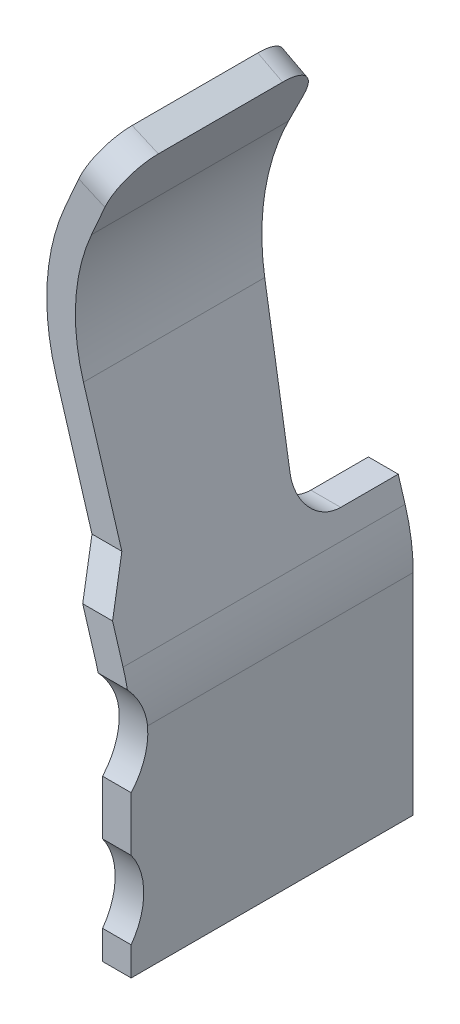
ISO-10303-21;
HEADER;
FILE_DESCRIPTION(('STEP AP214'),'2;1');
FILE_NAME('part.step','',(''),(''),'','','');
FILE_SCHEMA(('AUTOMOTIVE_DESIGN { 1 0 10303 214 1 1 1 1 }'));
ENDSEC;
DATA;
#1=APPLICATION_CONTEXT('core data for automotive mechanical design processes');
#2=APPLICATION_PROTOCOL_DEFINITION('international standard','automotive_design',2000,#1);
#3=PRODUCT_CONTEXT('',#1,'mechanical');
#4=PRODUCT('Part','Part','',(#3));
#5=PRODUCT_RELATED_PRODUCT_CATEGORY('part','',(#4));
#6=PRODUCT_DEFINITION_FORMATION('','',#4);
#7=PRODUCT_DEFINITION_CONTEXT('part definition',#1,'design');
#8=PRODUCT_DEFINITION('design','',#6,#7);
#9=PRODUCT_DEFINITION_SHAPE('','',#8);
#10=(LENGTH_UNIT() NAMED_UNIT(*) SI_UNIT(.MILLI.,.METRE.));
#11=(NAMED_UNIT(*) PLANE_ANGLE_UNIT() SI_UNIT($,.RADIAN.));
#12=(NAMED_UNIT(*) SI_UNIT($,.STERADIAN.) SOLID_ANGLE_UNIT());
#13=UNCERTAINTY_MEASURE_WITH_UNIT(LENGTH_MEASURE(1.E-05),#10,'distance_accuracy_value','');
#14=(GEOMETRIC_REPRESENTATION_CONTEXT(3) GLOBAL_UNCERTAINTY_ASSIGNED_CONTEXT((#13)) GLOBAL_UNIT_ASSIGNED_CONTEXT((#10,
#11,#12)) REPRESENTATION_CONTEXT('',''));
#15=CARTESIAN_POINT('',(0.,0.,0.));
#16=DIRECTION('',(0.,0.,1.));
#17=DIRECTION('',(1.,0.,0.));
#18=AXIS2_PLACEMENT_3D('',#15,#16,#17);
#19=CARTESIAN_POINT('',(6.95844493318108,3.52330708865174,0.423604352914839));
#20=DIRECTION('',(0.915327071470027,-0.402711251685502,0.));
#21=DIRECTION('',(0.402711251685502,0.915327071470027,0.));
#22=AXIS2_PLACEMENT_3D('',#19,#20,#21);
#23=CYLINDRICAL_SURFACE('',#22,0.2);
#24=CARTESIAN_POINT('',(6.95844493318108,3.52330708865174,0.423604352914839));
#25=DIRECTION('',(-0.915327071470027,0.402711251685502,0.));
#26=DIRECTION('',(0.402711251685502,0.915327071470027,0.));
#27=AXIS2_PLACEMENT_3D('',#24,#25,#26);
#28=CIRCLE('',#27,0.2);
#29=CARTESIAN_POINT('',(6.95844493318108,3.52330708865174,0.623604352914839));
#30=VERTEX_POINT('',#29);
#31=CARTESIAN_POINT('',(7.03898718351818,3.70637250294574,0.423604352914839));
#32=VERTEX_POINT('',#31);
#33=EDGE_CURVE('E378',#30,#32,#28,.T.);
#34=ORIENTED_EDGE('',*,*,#33,.F.);
#35=DIRECTION('',(-0.915327071470027,0.402711251685503,0.));
#36=VECTOR('',#35,1.);
#37=CARTESIAN_POINT('',(-17.6515059297135,14.3508073613119,0.623604352914805));
#38=LINE('',#37,#36);
#39=CARTESIAN_POINT('',(7.09574399390159,3.46290040089891,0.623604352914839));
#40=VERTEX_POINT('',#39);
#41=EDGE_CURVE('E26',#40,#30,#38,.T.);
#42=ORIENTED_EDGE('',*,*,#41,.F.);
#43=CARTESIAN_POINT('',(7.09574399390159,3.46290040089891,0.423604352914839));
#44=DIRECTION('',(0.915327071470027,-0.402711251685502,0.));
#45=DIRECTION('',(-0.402711251685502,-0.915327071470027,0.));
#46=AXIS2_PLACEMENT_3D('',#43,#44,#45);
#47=CIRCLE('',#46,0.2);
#48=CARTESIAN_POINT('',(7.17628624423868,3.64596581519291,0.423604352914839));
#49=VERTEX_POINT('',#48);
#50=EDGE_CURVE('E396',#49,#40,#47,.T.);
#51=ORIENTED_EDGE('',*,*,#50,.F.);
#52=DIRECTION('',(0.915327071470027,-0.402711251685503,0.));
#53=VECTOR('',#52,1.);
#54=CARTESIAN_POINT('',(7.03898718351818,3.70637250294574,0.423604352914839));
#55=LINE('',#54,#53);
#56=EDGE_CURVE('E336',#32,#49,#55,.T.);
#57=ORIENTED_EDGE('',*,*,#56,.F.);
#58=EDGE_LOOP('',(#34,#42,#51,#57));
#59=FACE_BOUND('',#58,.T.);
#60=ADVANCED_FACE('F16',(#59),#23,.T.);
#61=CARTESIAN_POINT('',(6.93613725867001,3.53312166947706,-0.236832722369337));
#62=DIRECTION('',(-0.914255270392899,0.402239697454472,-0.0483789866630451));
#63=DIRECTION('',(-0.402711251685501,-0.915327071470027,0.));
#64=AXIS2_PLACEMENT_3D('',#61,#62,#63);
#65=CYLINDRICAL_SURFACE('',#64,0.2);
#66=CARTESIAN_POINT('',(7.08694053804578,3.44289092405021,-0.427421697659668));
#67=CARTESIAN_POINT('',(7.13801746519236,3.55898426375477,-0.441384710680955));
#68=CARTESIAN_POINT('',(7.17628624423868,3.64596581519291,-0.356133634256613));
#69=CARTESIAN_POINT('',(7.17628624423869,3.64596581519291,-0.228386927890316));
#70=(BOUNDED_CURVE() B_SPLINE_CURVE(3,(#66,#67,#68,#69),.UNSPECIFIED.,.F.,
.F.) B_SPLINE_CURVE_WITH_KNOTS((4,4),(6.17366415670651,7.85398163397443),
.UNSPECIFIED.) CURVE() GEOMETRIC_REPRESENTATION_ITEM() RATIONAL_B_SPLINE_CURVE((1.,
0.77822974253387,0.77822974253387,1.)) REPRESENTATION_ITEM(''));
#71=CARTESIAN_POINT('',(7.08694053804578,3.44289092405021,-0.427421697659668));
#72=VERTEX_POINT('',#71);
#73=CARTESIAN_POINT('',(7.17628624423869,3.64596581519291,-0.228386927890316));
#74=VERTEX_POINT('',#73);
#75=EDGE_CURVE('E335',#72,#74,#70,.T.);
#76=ORIENTED_EDGE('',*,*,#75,.F.);
#77=DIRECTION('',(0.914255270392898,-0.402239697454473,0.0483789866630451));
#78=VECTOR('',#77,1.);
#79=CARTESIAN_POINT('',(-18.251852655037,14.5910558161891,-1.76825633941021));
#80=LINE('',#79,#78);
#81=CARTESIAN_POINT('',(6.94964147732528,3.50329761180303,-0.434687053017796));
#82=VERTEX_POINT('',#81);
#83=EDGE_CURVE('E11',#82,#72,#80,.T.);
#84=ORIENTED_EDGE('',*,*,#83,.F.);
#85=CARTESIAN_POINT('',(7.03898718351819,3.70637250294574,-0.235652283248443));
#86=CARTESIAN_POINT('',(7.03898718351819,3.70637250294574,-0.363398989614741));
#87=CARTESIAN_POINT('',(7.00071840447187,3.6193909515076,-0.448650066039083));
#88=CARTESIAN_POINT('',(6.94964147732528,3.50329761180303,-0.434687053017796));
#89=(BOUNDED_CURVE() B_SPLINE_CURVE(3,(#85,#86,#87,#88),.UNSPECIFIED.,.F.,
.F.) B_SPLINE_CURVE_WITH_KNOTS((4,4),(4.71238898038476,6.39270645765268),
.UNSPECIFIED.) CURVE() GEOMETRIC_REPRESENTATION_ITEM() RATIONAL_B_SPLINE_CURVE((1.,
0.77822974253387,0.77822974253387,1.)) REPRESENTATION_ITEM(''));
#90=CARTESIAN_POINT('',(7.03898718351819,3.70637250294574,-0.235652283248443));
#91=VERTEX_POINT('',#90);
#92=EDGE_CURVE('E373',#91,#82,#89,.T.);
#93=ORIENTED_EDGE('',*,*,#92,.F.);
#94=DIRECTION('',(-0.914255270392898,0.402239697454473,-0.0483789866630451));
#95=VECTOR('',#94,1.);
#96=CARTESIAN_POINT('',(7.01667950900711,3.71618708377106,-0.236832722369337));
#97=LINE('',#96,#95);
#98=EDGE_CURVE('E353',#74,#91,#97,.T.);
#99=ORIENTED_EDGE('',*,*,#98,.F.);
#100=EDGE_LOOP('',(#76,#84,#93,#99));
#101=FACE_BOUND('',#100,.T.);
#102=ADVANCED_FACE('F509',(#101),#65,.T.);
#103=CARTESIAN_POINT('',(-23.11,1.65634067151207,-0.212546111318104));
#104=DIRECTION('',(0.,-1.,0.));
#105=DIRECTION('',(0.,0.,-1.));
#106=AXIS2_PLACEMENT_3D('',#103,#104,#105);
#107=PLANE('',#106);
#108=DIRECTION('',(0.,0.,-1.));
#109=VECTOR('',#108,1.);
#110=CARTESIAN_POINT('',(7.11483507894154,1.65634067151207,-0.740000000000018));
#111=LINE('',#110,#109);
#112=CARTESIAN_POINT('',(7.11483507894154,1.65634067151207,-0.438042305987952));
#113=VERTEX_POINT('',#112);
#114=CARTESIAN_POINT('',(7.11483507894154,1.65634067151207,-0.740000000000018));
#115=VERTEX_POINT('',#114);
#116=EDGE_CURVE('E316',#113,#115,#111,.T.);
#117=ORIENTED_EDGE('',*,*,#116,.F.);
#118=DIRECTION('',(1.,0.,0.));
#119=VECTOR('',#118,1.);
#120=CARTESIAN_POINT('',(7.27150340910557,1.65634067151207,-0.438042305987951));
#121=LINE('',#120,#119);
#122=CARTESIAN_POINT('',(7.27150340910558,1.65634067151207,-0.438042305987951));
#123=VERTEX_POINT('',#122);
#124=EDGE_CURVE('E292',#113,#123,#121,.T.);
#125=ORIENTED_EDGE('',*,*,#124,.T.);
#126=DIRECTION('',(0.,0.,1.));
#127=VECTOR('',#126,1.);
#128=CARTESIAN_POINT('',(7.27150340910558,1.65634067151207,-0.740000000000018));
#129=LINE('',#128,#127);
#130=CARTESIAN_POINT('',(7.27150340910558,1.65634067151207,-0.740000000000018));
#131=VERTEX_POINT('',#130);
#132=EDGE_CURVE('E258',#131,#123,#129,.T.);
#133=ORIENTED_EDGE('',*,*,#132,.F.);
#134=DIRECTION('',(-1.,0.,0.));
#135=VECTOR('',#134,1.);
#136=CARTESIAN_POINT('',(6.35,1.65634067151207,-0.740000000000019));
#137=LINE('',#136,#135);
#138=EDGE_CURVE('E255',#131,#115,#137,.T.);
#139=ORIENTED_EDGE('',*,*,#138,.T.);
#140=EDGE_LOOP('',(#117,#125,#133,#139));
#141=FACE_BOUND('',#140,.T.);
#142=ADVANCED_FACE('F488',(#141),#107,.F.);
#143=CARTESIAN_POINT('',(-23.11,3.70637250294571,-0.459111687165995));
#144=DIRECTION('',(0.,0.119413416546905,0.992844618230162));
#145=DIRECTION('',(1.,0.,0.));
#146=AXIS2_PLACEMENT_3D('',#143,#144,#145);
#147=PLANE('',#146);
#148=DIRECTION('',(-0.28674853992682,0.951150986717314,-0.11439875574724));
#149=VECTOR('',#148,1.);
#150=CARTESIAN_POINT('',(7.2896639548885,1.59610175610151,-0.205300934614502));
#151=LINE('',#150,#149);
#152=CARTESIAN_POINT('',(7.20400830743363,1.88022335482146,-0.239473382341919));
#153=VERTEX_POINT('',#152);
#154=CARTESIAN_POINT('',(6.98341373590366,2.61194022573825,-0.327479914176621));
#155=VERTEX_POINT('',#154);
#156=EDGE_CURVE('E200',#153,#155,#151,.T.);
#157=ORIENTED_EDGE('',*,*,#156,.F.);
#158=DIRECTION('',(-1.,0.,0.));
#159=VECTOR('',#158,1.);
#160=CARTESIAN_POINT('',(7.11483507894153,1.88022335482146,-0.23947338234192));
#161=LINE('',#160,#159);
#162=CARTESIAN_POINT('',(7.04733997726959,1.88022335482146,-0.23947338234192));
#163=VERTEX_POINT('',#162);
#164=EDGE_CURVE('E303',#153,#163,#161,.T.);
#165=ORIENTED_EDGE('',*,*,#164,.T.);
#166=DIRECTION('',(0.286748539926818,-0.951150986717315,0.11439875574724));
#167=VECTOR('',#166,1.);
#168=CARTESIAN_POINT('',(7.14587763511194,1.55337185451571,-0.200161637444145));
#169=LINE('',#168,#167);
#170=CARTESIAN_POINT('',(6.83979823954622,2.56864369924933,-0.322272466749579));
#171=VERTEX_POINT('',#170);
#172=EDGE_CURVE('E280',#171,#163,#169,.T.);
#173=ORIENTED_EDGE('',*,*,#172,.F.);
#174=CARTESIAN_POINT('',(6.88822424609608,3.36370167510267,-0.417897288102545));
#175=CARTESIAN_POINT('',(6.77669920509328,3.11021511680704,-0.387409439934768));
#176=CARTESIAN_POINT('',(6.75986260540396,2.83379189253285,-0.354162906673266));
#177=CARTESIAN_POINT('',(6.83979823954622,2.56864369924933,-0.322272466749579));
#178=(BOUNDED_CURVE() B_SPLINE_CURVE(3,(#174,#175,#176,#177),.UNSPECIFIED.,.F.,
.F.) B_SPLINE_CURVE_WITH_KNOTS((4,4),(4.29791199977039,5.00519872138853),
.UNSPECIFIED.) CURVE() GEOMETRIC_REPRESENTATION_ITEM() RATIONAL_B_SPLINE_CURVE((1.,
0.958744787021091,0.958744787021091,1.)) REPRESENTATION_ITEM(''));
#179=CARTESIAN_POINT('',(6.88822424609608,3.36370167510267,-0.417897288102545));
#180=VERTEX_POINT('',#179);
#181=EDGE_CURVE('E348',#180,#171,#178,.T.);
#182=ORIENTED_EDGE('',*,*,#181,.F.);
#183=DIRECTION('',(-0.400292818236851,-0.909830186054405,0.109428936813832));
#184=VECTOR('',#183,1.);
#185=CARTESIAN_POINT('',(6.90233351008822,3.39577078475993,-0.421754368938234));
#186=LINE('',#185,#184);
#187=EDGE_CURVE('E526',#82,#180,#186,.T.);
#188=ORIENTED_EDGE('',*,*,#187,.F.);
#189=ORIENTED_EDGE('',*,*,#83,.T.);
#190=DIRECTION('',(0.400292818236852,0.909830186054405,-0.109428936813832));
#191=VECTOR('',#190,1.);
#192=CARTESIAN_POINT('',(7.03995081965593,3.33608744850051,-0.414576013974332));
#193=LINE('',#192,#191);
#194=CARTESIAN_POINT('',(7.02552330681659,3.30329498734983,-0.410631932744417));
#195=VERTEX_POINT('',#194);
#196=EDGE_CURVE('E331',#195,#72,#193,.T.);
#197=ORIENTED_EDGE('',*,*,#196,.F.);
#198=CARTESIAN_POINT('',(6.98341373590366,2.61194022573825,-0.327479914176621));
#199=CARTESIAN_POINT('',(6.91390448882344,2.84250387207174,-0.355210731501565));
#200=CARTESIAN_POINT('',(6.9285450102924,3.08287189317973,-0.384120760424611));
#201=CARTESIAN_POINT('',(7.02552330681659,3.30329498734983,-0.410631932744417));
#202=(BOUNDED_CURVE() B_SPLINE_CURVE(3,(#198,#199,#200,#201),.UNSPECIFIED.,.F.,
.F.) B_SPLINE_CURVE_WITH_KNOTS((4,4),(1.27798658579106,1.98527330740919),
.UNSPECIFIED.) CURVE() GEOMETRIC_REPRESENTATION_ITEM() RATIONAL_B_SPLINE_CURVE((1.,
0.958744787021091,0.958744787021091,1.)) REPRESENTATION_ITEM(''));
#203=EDGE_CURVE('E268',#155,#195,#202,.T.);
#204=ORIENTED_EDGE('',*,*,#203,.F.);
#205=EDGE_LOOP('',(#157,#165,#173,#182,#188,#189,#197,#204));
#206=FACE_BOUND('',#205,.T.);
#207=ADVANCED_FACE('F484',(#206),#147,.F.);
#208=CARTESIAN_POINT('',(-23.11,1.94413292378283,0.623604352914797));
#209=DIRECTION('',(0.,0.,-1.));
#210=DIRECTION('',(0.,-1.,0.));
#211=AXIS2_PLACEMENT_3D('',#208,#209,#210);
#212=PLANE('',#211);
#213=DIRECTION('',(-0.402711251685501,-0.915327071470028,0.));
#214=VECTOR('',#213,1.);
#215=CARTESIAN_POINT('',(7.02552330681659,3.30329498734984,0.623604352914839));
#216=LINE('',#215,#214);
#217=CARTESIAN_POINT('',(7.02552330681659,3.30329498734984,0.623604352914839));
#218=VERTEX_POINT('',#217);
#219=EDGE_CURVE('E389',#40,#218,#216,.T.);
#220=ORIENTED_EDGE('',*,*,#219,.F.);
#221=ORIENTED_EDGE('',*,*,#41,.T.);
#222=DIRECTION('',(0.4027112516855,0.915327071470028,0.));
#223=VECTOR('',#222,1.);
#224=CARTESIAN_POINT('',(6.88822424609608,3.36370167510267,0.623604352914839));
#225=LINE('',#224,#223);
#226=CARTESIAN_POINT('',(6.88822424609608,3.36370167510267,0.623604352914839));
#227=VERTEX_POINT('',#226);
#228=EDGE_CURVE('E522',#227,#30,#225,.T.);
#229=ORIENTED_EDGE('',*,*,#228,.F.);
#230=CARTESIAN_POINT('',(7.94085037828661,2.90058373566433,0.62360435291484));
#231=DIRECTION('',(0.,0.,-1.));
#232=DIRECTION('',(-1.,0.,0.));
#233=AXIS2_PLACEMENT_3D('',#230,#231,#232);
#234=CIRCLE('',#233,1.15);
#235=CARTESIAN_POINT('',(6.83979823954622,2.56864369924933,0.623604352914839));
#236=VERTEX_POINT('',#235);
#237=EDGE_CURVE('E374',#236,#227,#234,.T.);
#238=ORIENTED_EDGE('',*,*,#237,.F.);
#239=DIRECTION('',(-0.288643509926088,0.957436642382956,0.));
#240=VECTOR('',#239,1.);
#241=CARTESIAN_POINT('',(7.16382114602551,1.49385284836845,0.623604352914839));
#242=LINE('',#241,#240);
#243=CARTESIAN_POINT('',(7.02807282006432,1.94413292378283,0.623604352914839));
#244=VERTEX_POINT('',#243);
#245=EDGE_CURVE('E325',#244,#236,#242,.T.);
#246=ORIENTED_EDGE('',*,*,#245,.F.);
#247=DIRECTION('',(1.,0.,0.));
#248=VECTOR('',#247,1.);
#249=CARTESIAN_POINT('',(-23.11,1.94413292378283,0.623604352914797));
#250=LINE('',#249,#248);
#251=CARTESIAN_POINT('',(7.18474115022836,1.94413292378283,0.623604352914839));
#252=VERTEX_POINT('',#251);
#253=EDGE_CURVE('E541',#244,#252,#250,.T.);
#254=ORIENTED_EDGE('',*,*,#253,.T.);
#255=DIRECTION('',(0.28864350992609,-0.957436642382956,0.));
#256=VECTOR('',#255,1.);
#257=CARTESIAN_POINT('',(7.30743664238296,1.53714937485737,0.623604352914839));
#258=LINE('',#257,#256);
#259=CARTESIAN_POINT('',(6.98341373590366,2.61194022573825,0.623604352914839));
#260=VERTEX_POINT('',#259);
#261=EDGE_CURVE('E321',#260,#252,#258,.T.);
#262=ORIENTED_EDGE('',*,*,#261,.F.);
#263=CARTESIAN_POINT('',(7.94085037828661,2.90058373566433,0.62360435291484));
#264=DIRECTION('',(0.,0.,1.));
#265=DIRECTION('',(-1.,0.,0.));
#266=AXIS2_PLACEMENT_3D('',#263,#264,#265);
#267=CIRCLE('',#266,1.);
#268=EDGE_CURVE('E259',#218,#260,#267,.T.);
#269=ORIENTED_EDGE('',*,*,#268,.F.);
#270=EDGE_LOOP('',(#220,#221,#229,#238,#246,#254,#262,#269));
#271=FACE_BOUND('',#270,.T.);
#272=ADVANCED_FACE('F487',(#271),#212,.F.);
#273=CARTESIAN_POINT('',(-23.11,1.7003498353216,0.749999999999972));
#274=DIRECTION('',(0.,-0.460287319631494,-0.887770005906065));
#275=DIRECTION('',(0.,-0.887770005906065,0.460287319631494));
#276=AXIS2_PLACEMENT_3D('',#273,#274,#275);
#277=PLANE('',#276);
#278=DIRECTION('',(-1.,0.,0.));
#279=VECTOR('',#278,1.);
#280=CARTESIAN_POINT('',(6.35,1.7196371362757,0.739999999999981));
#281=LINE('',#280,#279);
#282=CARTESIAN_POINT('',(7.25242108767926,1.7196371362757,0.739999999999982));
#283=VERTEX_POINT('',#282);
#284=CARTESIAN_POINT('',(7.09575275751522,1.7196371362757,0.739999999999982));
#285=VERTEX_POINT('',#284);
#286=EDGE_CURVE('E313',#283,#285,#281,.T.);
#287=ORIENTED_EDGE('',*,*,#286,.F.);
#288=DIRECTION('',(0.258541028225372,-0.857586072334425,0.444637678635293));
#289=VECTOR('',#288,1.);
#290=CARTESIAN_POINT('',(7.12642343830643,2.13757401070795,0.523309818502748));
#291=LINE('',#290,#289);
#292=EDGE_CURVE('E251',#252,#283,#291,.T.);
#293=ORIENTED_EDGE('',*,*,#292,.F.);
#294=ORIENTED_EDGE('',*,*,#253,.F.);
#295=DIRECTION('',(-0.258541028225371,0.857586072334425,-0.444637678635293));
#296=VECTOR('',#295,1.);
#297=CARTESIAN_POINT('',(6.9802273619162,2.10283732290249,0.541319952677684));
#298=LINE('',#297,#296);
#299=EDGE_CURVE('E330',#285,#244,#298,.T.);
#300=ORIENTED_EDGE('',*,*,#299,.F.);
#301=EDGE_LOOP('',(#287,#293,#294,#300));
#302=FACE_BOUND('',#301,.T.);
#303=ADVANCED_FACE('F499',(#302),#277,.F.);
#304=CARTESIAN_POINT('',(6.35,1.24850586493128,0.739999999999981));
#305=DIRECTION('',(0.,0.,-1.));
#306=DIRECTION('',(0.,-1.,0.));
#307=AXIS2_PLACEMENT_3D('',#304,#305,#306);
#308=PLANE('',#307);
#309=DIRECTION('',(0.,-1.,0.));
#310=VECTOR('',#309,1.);
#311=CARTESIAN_POINT('',(7.35,0.145965815192914,0.739999999999982));
#312=LINE('',#311,#310);
#313=CARTESIAN_POINT('',(7.35,0.296740599868486,0.739999999999982));
#314=VERTEX_POINT('',#313);
#315=CARTESIAN_POINT('',(7.35,0.145965815192914,0.739999999999982));
#316=VERTEX_POINT('',#315);
#317=EDGE_CURVE('E241',#314,#316,#312,.T.);
#318=ORIENTED_EDGE('',*,*,#317,.F.);
#319=DIRECTION('',(-1.,0.,0.));
#320=VECTOR('',#319,1.);
#321=CARTESIAN_POINT('',(-23.11,0.296740599868486,0.73999999999994));
#322=LINE('',#321,#320);
#323=CARTESIAN_POINT('',(7.2,0.296740599868486,0.739999999999982));
#324=VERTEX_POINT('',#323);
#325=EDGE_CURVE('E368',#314,#324,#322,.T.);
#326=ORIENTED_EDGE('',*,*,#325,.T.);
#327=DIRECTION('',(0.,1.,0.));
#328=VECTOR('',#327,1.);
#329=CARTESIAN_POINT('',(7.2,0.145965815192914,0.739999999999982));
#330=LINE('',#329,#328);
#331=CARTESIAN_POINT('',(7.2,0.145965815192914,0.739999999999982));
#332=VERTEX_POINT('',#331);
#333=EDGE_CURVE('E286',#332,#324,#330,.T.);
#334=ORIENTED_EDGE('',*,*,#333,.F.);
#335=DIRECTION('',(-1.,0.,0.));
#336=VECTOR('',#335,1.);
#337=CARTESIAN_POINT('',(7.2,0.145965815192914,0.739999999999982));
#338=LINE('',#337,#336);
#339=EDGE_CURVE('E363',#316,#332,#338,.T.);
#340=ORIENTED_EDGE('',*,*,#339,.F.);
#341=EDGE_LOOP('',(#318,#326,#334,#340));
#342=FACE_BOUND('',#341,.T.);
#343=ADVANCED_FACE('F495',(#342),#308,.F.);
#344=CARTESIAN_POINT('',(6.35,1.24850586493128,-0.740000000000019));
#345=DIRECTION('',(0.,0.,-1.));
#346=DIRECTION('',(0.,-1.,0.));
#347=AXIS2_PLACEMENT_3D('',#344,#345,#346);
#348=PLANE('',#347);
#349=ORIENTED_EDGE('',*,*,#138,.F.);
#350=DIRECTION('',(0.28864350992609,-0.957436642382956,0.));
#351=VECTOR('',#350,1.);
#352=CARTESIAN_POINT('',(7.30743664238296,1.53714937485737,-0.740000000000018));
#353=LINE('',#352,#351);
#354=CARTESIAN_POINT('',(7.30743664238296,1.53714937485737,-0.740000000000018));
#355=VERTEX_POINT('',#354);
#356=EDGE_CURVE('E246',#131,#355,#353,.T.);
#357=ORIENTED_EDGE('',*,*,#356,.T.);
#358=CARTESIAN_POINT('',(6.35,1.24850586493128,-0.740000000000019));
#359=DIRECTION('',(0.,0.,-1.));
#360=DIRECTION('',(-1.,0.,0.));
#361=AXIS2_PLACEMENT_3D('',#358,#359,#360);
#362=CIRCLE('',#361,1.);
#363=CARTESIAN_POINT('',(7.35,1.24850586493128,-0.740000000000018));
#364=VERTEX_POINT('',#363);
#365=EDGE_CURVE('E231',#355,#364,#362,.T.);
#366=ORIENTED_EDGE('',*,*,#365,.T.);
#367=DIRECTION('',(0.,-1.,0.));
#368=VECTOR('',#367,1.);
#369=CARTESIAN_POINT('',(7.35,0.145965815192914,-0.740000000000018));
#370=LINE('',#369,#368);
#371=CARTESIAN_POINT('',(7.35,0.145965815192914,-0.740000000000018));
#372=VERTEX_POINT('',#371);
#373=EDGE_CURVE('E41',#364,#372,#370,.T.);
#374=ORIENTED_EDGE('',*,*,#373,.T.);
#375=DIRECTION('',(-1.,0.,0.));
#376=VECTOR('',#375,1.);
#377=CARTESIAN_POINT('',(7.2,0.145965815192914,-0.740000000000018));
#378=LINE('',#377,#376);
#379=CARTESIAN_POINT('',(7.2,0.145965815192914,-0.740000000000018));
#380=VERTEX_POINT('',#379);
#381=EDGE_CURVE('E417',#372,#380,#378,.T.);
#382=ORIENTED_EDGE('',*,*,#381,.T.);
#383=DIRECTION('',(0.,1.,0.));
#384=VECTOR('',#383,1.);
#385=CARTESIAN_POINT('',(7.2,0.145965815192914,-0.740000000000018));
#386=LINE('',#385,#384);
#387=CARTESIAN_POINT('',(7.2,1.24850586493128,-0.740000000000018));
#388=VERTEX_POINT('',#387);
#389=EDGE_CURVE('E282',#380,#388,#386,.T.);
#390=ORIENTED_EDGE('',*,*,#389,.T.);
#391=CARTESIAN_POINT('',(6.35,1.24850586493128,-0.740000000000019));
#392=DIRECTION('',(0.,0.,1.));
#393=DIRECTION('',(-1.,0.,0.));
#394=AXIS2_PLACEMENT_3D('',#391,#392,#393);
#395=CIRCLE('',#394,0.85);
#396=CARTESIAN_POINT('',(7.16382114602551,1.49385284836845,-0.740000000000018));
#397=VERTEX_POINT('',#396);
#398=EDGE_CURVE('E276',#388,#397,#395,.T.);
#399=ORIENTED_EDGE('',*,*,#398,.T.);
#400=DIRECTION('',(-0.288643509926088,0.957436642382956,0.));
#401=VECTOR('',#400,1.);
#402=CARTESIAN_POINT('',(7.16382114602551,1.49385284836845,-0.740000000000018));
#403=LINE('',#402,#401);
#404=EDGE_CURVE('E320',#397,#115,#403,.T.);
#405=ORIENTED_EDGE('',*,*,#404,.T.);
#406=EDGE_LOOP('',(#349,#357,#366,#374,#382,#390,#399,#405));
#407=FACE_BOUND('',#406,.T.);
#408=ADVANCED_FACE('F253',(#407),#348,.T.);
#409=CARTESIAN_POINT('',(7.35,0.145965815192914,-0.740000000000018));
#410=DIRECTION('',(-1.,0.,0.));
#411=DIRECTION('',(0.,0.,1.));
#412=AXIS2_PLACEMENT_3D('',#409,#410,#411);
#413=PLANE('',#412);
#414=DIRECTION('',(0.,0.,1.));
#415=VECTOR('',#414,1.);
#416=CARTESIAN_POINT('',(7.35,1.24850586493128,-0.740000000000018));
#417=LINE('',#416,#415);
#418=CARTESIAN_POINT('',(7.35,1.24850586493128,0.654029100989327));
#419=VERTEX_POINT('',#418);
#420=EDGE_CURVE('E237',#364,#419,#417,.T.);
#421=ORIENTED_EDGE('',*,*,#420,.T.);
#422=CARTESIAN_POINT('',(7.35,1.21669179396546,0.995153761033099));
#423=DIRECTION('',(1.,0.,0.));
#424=DIRECTION('',(0.,0.,1.));
#425=AXIS2_PLACEMENT_3D('',#422,#423,#424);
#426=CIRCLE('',#425,0.342604974863759);
#427=CARTESIAN_POINT('',(7.35,0.988055123608201,0.739999999999982));
#428=VERTEX_POINT('',#427);
#429=EDGE_CURVE('E431',#428,#419,#426,.T.);
#430=ORIENTED_EDGE('',*,*,#429,.F.);
#431=DIRECTION('',(0.,-1.,0.));
#432=VECTOR('',#431,1.);
#433=CARTESIAN_POINT('',(7.35,0.145965815192914,0.739999999999982));
#434=LINE('',#433,#432);
#435=CARTESIAN_POINT('',(7.35,0.703259400131467,0.739999999999982));
#436=VERTEX_POINT('',#435);
#437=EDGE_CURVE('E364',#428,#436,#434,.T.);
#438=ORIENTED_EDGE('',*,*,#437,.T.);
#439=CARTESIAN_POINT('',(7.35,0.499999999999977,1.01942683457021));
#440=DIRECTION('',(1.,0.,0.));
#441=DIRECTION('',(0.,0.,1.));
#442=AXIS2_PLACEMENT_3D('',#439,#440,#441);
#443=CIRCLE('',#442,0.345533991988848);
#444=EDGE_CURVE('E275',#314,#436,#443,.T.);
#445=ORIENTED_EDGE('',*,*,#444,.F.);
#446=ORIENTED_EDGE('',*,*,#317,.T.);
#447=DIRECTION('',(0.,0.,1.));
#448=VECTOR('',#447,1.);
#449=CARTESIAN_POINT('',(7.35,0.145965815192914,-0.740000000000018));
#450=LINE('',#449,#448);
#451=EDGE_CURVE('E410',#372,#316,#450,.T.);
#452=ORIENTED_EDGE('',*,*,#451,.F.);
#453=ORIENTED_EDGE('',*,*,#373,.F.);
#454=EDGE_LOOP('',(#421,#430,#438,#445,#446,#452,#453));
#455=FACE_BOUND('',#454,.T.);
#456=ADVANCED_FACE('F481',(#455),#413,.F.);
#457=CARTESIAN_POINT('',(6.35,1.24850586493128,-0.740000000000019));
#458=DIRECTION('',(0.,0.,1.));
#459=DIRECTION('',(1.,0.,0.));
#460=AXIS2_PLACEMENT_3D('',#457,#458,#459);
#461=CYLINDRICAL_SURFACE('',#460,1.);
#462=CARTESIAN_POINT('',(6.35,1.24850586493128,0.739999999999981));
#463=DIRECTION('',(0.,0.,-1.));
#464=DIRECTION('',(-1.,0.,0.));
#465=AXIS2_PLACEMENT_3D('',#462,#463,#464);
#466=CIRCLE('',#465,1.);
#467=CARTESIAN_POINT('',(7.30743664238296,1.53714937485737,0.739999999999982));
#468=VERTEX_POINT('',#467);
#469=CARTESIAN_POINT('',(7.33043911813472,1.44532846432271,0.739999999999982));
#470=VERTEX_POINT('',#469);
#471=EDGE_CURVE('E426',#468,#470,#466,.T.);
#472=ORIENTED_EDGE('',*,*,#471,.T.);
#473=CARTESIAN_POINT('',(7.33043911813472,1.44532846432271,0.739999999999982));
#474=CARTESIAN_POINT('',(7.33112131741684,1.44193024717417,0.736954698545496));
#475=CARTESIAN_POINT('',(7.33179721850851,1.43847176034264,0.733975045899673));
#476=CARTESIAN_POINT('',(7.333128559526,1.43145643098159,0.728168909339876));
#477=CARTESIAN_POINT('',(7.33378408931625,1.42790021102154,0.725341693611786));
#478=CARTESIAN_POINT('',(7.33507168816975,1.42068928784943,0.719840380711082));
#479=CARTESIAN_POINT('',(7.33570383827925,1.41703501951577,0.71716573280542));
#480=CARTESIAN_POINT('',(7.3369415721266,1.40962817005605,0.711969336935208));
#481=CARTESIAN_POINT('',(7.33754721552131,1.40587584366106,0.709447240161664));
#482=CARTESIAN_POINT('',(7.33872877129688,1.39827302810691,0.704555749407203));
#483=CARTESIAN_POINT('',(7.33930470888849,1.3944226264712,0.702186225501798));
#484=CARTESIAN_POINT('',(7.340423617226,1.38662388081493,0.697599649617223));
#485=CARTESIAN_POINT('',(7.3409665658168,1.38267547342748,0.695382699975703));
#486=CARTESIAN_POINT('',(7.34201619604996,1.37468096295891,0.691101059928101));
#487=CARTESIAN_POINT('',(7.34252279573887,1.37063466501766,0.689036713287234));
#488=CARTESIAN_POINT('',(7.34349635159398,1.36244473872734,0.685059955148872));
#489=CARTESIAN_POINT('',(7.34396315439605,1.35830080604148,0.683148133100298));
#490=CARTESIAN_POINT('',(7.34485385101726,1.34991442649087,0.679475891500459));
#491=CARTESIAN_POINT('',(7.34527749507102,1.34567156354324,0.677716361222166));
#492=CARTESIAN_POINT('',(7.34607352805794,1.33713872195216,0.674376033868776));
#493=CARTESIAN_POINT('',(7.34644618935103,1.33284913740271,0.672794295796527));
#494=CARTESIAN_POINT('',(7.34713863854792,1.32422362544486,0.669809238507249));
#495=CARTESIAN_POINT('',(7.34745863414995,1.31988795555424,0.668405223722618));
#496=CARTESIAN_POINT('',(7.34804414411012,1.3111710125325,0.665775382478355));
#497=CARTESIAN_POINT('',(7.34830979142469,1.30678987892384,0.664549123358638));
#498=CARTESIAN_POINT('',(7.34878499367846,1.29798278695399,0.662274523841769));
#499=CARTESIAN_POINT('',(7.34899459796072,1.29355687160846,0.661226027233375));
#500=CARTESIAN_POINT('',(7.34935611224076,1.28466100981375,0.659306657193404));
#501=CARTESIAN_POINT('',(7.34950798054882,1.28019103392983,0.65843591232121));
#502=CARTESIAN_POINT('',(7.34975239151872,1.27120787033427,0.656871822149784));
#503=CARTESIAN_POINT('',(7.34984479570128,1.26669460642052,0.65617889318396));
#504=CARTESIAN_POINT('',(7.34996875637607,1.25762568522579,0.654969909316688));
#505=CARTESIAN_POINT('',(7.35000007412201,1.25306993125335,0.654454554866671));
#506=CARTESIAN_POINT('',(7.35,1.24850586493128,0.654029100989326));
#507=B_SPLINE_CURVE_WITH_KNOTS('',3,(#473,#474,#475,#476,#477,#478,#479,#480,#481,#482,#483,
#484,#485,#486,#487,#488,#489,#490,#491,#492,#493,#494,#495,#496,#497,#498,#499,#500,#501,#502,
#503,#504,#505,#506),.UNSPECIFIED.,.F.,.F.,(4,2,2,2,2,2,2,2,2,2,2,2,2,2,2,2,4),(0.,
0.0138407212062309,0.0276076629971238,0.0413212735161825,0.0550022400254229,0.0686713979831098,
0.0823496367920794,0.0960578043229843,0.109816612381107,0.123650992269108,0.137408310969834,
0.151110002599701,0.164777762982982,0.178433449670465,0.192098978145581,0.205796216649572,
0.219546882133365),.UNSPECIFIED.);
#508=EDGE_CURVE('E609',#470,#419,#507,.T.);
#509=ORIENTED_EDGE('',*,*,#508,.T.);
#510=ORIENTED_EDGE('',*,*,#420,.F.);
#511=ORIENTED_EDGE('',*,*,#365,.F.);
#512=DIRECTION('',(0.,0.,1.));
#513=VECTOR('',#512,1.);
#514=CARTESIAN_POINT('',(7.30743664238296,1.53714937485737,-0.740000000000018));
#515=LINE('',#514,#513);
#516=EDGE_CURVE('E234',#355,#468,#515,.T.);
#517=ORIENTED_EDGE('',*,*,#516,.T.);
#518=EDGE_LOOP('',(#472,#509,#510,#511,#517));
#519=FACE_BOUND('',#518,.T.);
#520=ADVANCED_FACE('F233',(#519),#461,.T.);
#521=CARTESIAN_POINT('',(7.30743664238296,1.53714937485737,-0.740000000000018));
#522=DIRECTION('',(-0.957436642382956,-0.28864350992609,0.));
#523=DIRECTION('',(-0.28864350992609,0.957436642382956,0.));
#524=AXIS2_PLACEMENT_3D('',#521,#522,#523);
#525=PLANE('',#524);
#526=ORIENTED_EDGE('',*,*,#356,.F.);
#527=ORIENTED_EDGE('',*,*,#132,.T.);
#528=CARTESIAN_POINT('',(7.27150340910558,1.65634067151207,-0.438042305987951));
#529=CARTESIAN_POINT('',(7.27150340910558,1.65634067151208,-0.320885018462571));
#530=CARTESIAN_POINT('',(7.24652837656353,1.73918338398669,-0.238042305987951));
#531=CARTESIAN_POINT('',(7.21120834682184,1.85634067151208,-0.238042305987952));
#532=(BOUNDED_CURVE() B_SPLINE_CURVE(3,(#528,#529,#530,#531),.UNSPECIFIED.,.F.,
.F.) B_SPLINE_CURVE_WITH_KNOTS((4,4),(3.1415926535898,4.71238898038469),
.UNSPECIFIED.) CURVE() GEOMETRIC_REPRESENTATION_ITEM() RATIONAL_B_SPLINE_CURVE((1.,
0.804737854124365,0.804737854124365,1.)) REPRESENTATION_ITEM(''));
#533=CARTESIAN_POINT('',(7.21120834682184,1.85634067151208,-0.238042305987952));
#534=VERTEX_POINT('',#533);
#535=EDGE_CURVE('E213',#123,#534,#532,.T.);
#536=ORIENTED_EDGE('',*,*,#535,.T.);
#537=CARTESIAN_POINT('',(7.21120834682184,1.85634067151208,-0.238042305987952));
#538=CARTESIAN_POINT('',(7.20880115558452,1.86432537588468,-0.238042305987952));
#539=CARTESIAN_POINT('',(7.20639827429864,1.87229578405696,-0.23851990151267));
#540=CARTESIAN_POINT('',(7.20400830743363,1.88022335482146,-0.239473382341919));
#541=(BOUNDED_CURVE() B_SPLINE_CURVE(3,(#537,#538,#539,#540),.UNSPECIFIED.,.F.,
.F.) B_SPLINE_CURVE_WITH_KNOTS((4,4),(4.71238898038469,4.83208803082147),
.UNSPECIFIED.) CURVE() GEOMETRIC_REPRESENTATION_ITEM() RATIONAL_B_SPLINE_CURVE((1.,
0.998806367803328,0.998806367803328,1.)) REPRESENTATION_ITEM(''));
#542=EDGE_CURVE('E293',#534,#153,#541,.T.);
#543=ORIENTED_EDGE('',*,*,#542,.T.);
#544=ORIENTED_EDGE('',*,*,#156,.T.);
#545=DIRECTION('',(0.,0.,1.));
#546=VECTOR('',#545,1.);
#547=CARTESIAN_POINT('',(6.98341373590366,2.61194022573825,-0.740000000000018));
#548=LINE('',#547,#546);
#549=EDGE_CURVE('E388',#155,#260,#548,.T.);
#550=ORIENTED_EDGE('',*,*,#549,.T.);
#551=ORIENTED_EDGE('',*,*,#261,.T.);
#552=ORIENTED_EDGE('',*,*,#292,.T.);
#553=DIRECTION('',(0.28864350992609,-0.957436642382956,0.));
#554=VECTOR('',#553,1.);
#555=CARTESIAN_POINT('',(7.30743664238296,1.53714937485737,0.739999999999982));
#556=LINE('',#555,#554);
#557=EDGE_CURVE('E249',#283,#468,#556,.T.);
#558=ORIENTED_EDGE('',*,*,#557,.T.);
#559=ORIENTED_EDGE('',*,*,#516,.F.);
#560=EDGE_LOOP('',(#526,#527,#536,#543,#544,#550,#551,#552,#558,#559));
#561=FACE_BOUND('',#560,.T.);
#562=ADVANCED_FACE('F245',(#561),#525,.F.);
#563=CARTESIAN_POINT('',(7.94085037828662,2.90058373566433,-0.740000000000017));
#564=DIRECTION('',(0.,0.,1.));
#565=DIRECTION('',(1.,0.,0.));
#566=AXIS2_PLACEMENT_3D('',#563,#564,#565);
#567=CYLINDRICAL_SURFACE('',#566,1.);
#568=ORIENTED_EDGE('',*,*,#549,.F.);
#569=ORIENTED_EDGE('',*,*,#203,.T.);
#570=DIRECTION('',(0.,0.,1.));
#571=VECTOR('',#570,1.);
#572=CARTESIAN_POINT('',(7.02552330681659,3.30329498734983,-0.740000000000018));
#573=LINE('',#572,#571);
#574=EDGE_CURVE('E384',#195,#218,#573,.T.);
#575=ORIENTED_EDGE('',*,*,#574,.T.);
#576=ORIENTED_EDGE('',*,*,#268,.T.);
#577=EDGE_LOOP('',(#568,#569,#575,#576));
#578=FACE_BOUND('',#577,.T.);
#579=ADVANCED_FACE('F477',(#578),#567,.F.);
#580=CARTESIAN_POINT('',(7.02552330681659,3.30329498734984,-0.740000000000018));
#581=DIRECTION('',(-0.915327071470028,0.402711251685501,0.));
#582=DIRECTION('',(0.,0.,1.));
#583=AXIS2_PLACEMENT_3D('',#580,#581,#582);
#584=PLANE('',#583);
#585=ORIENTED_EDGE('',*,*,#196,.T.);
#586=ORIENTED_EDGE('',*,*,#75,.T.);
#587=DIRECTION('',(0.,0.,1.));
#588=VECTOR('',#587,1.);
#589=CARTESIAN_POINT('',(7.17628624423869,3.64596581519291,-0.740000000000018));
#590=LINE('',#589,#588);
#591=EDGE_CURVE('E359',#74,#49,#590,.T.);
#592=ORIENTED_EDGE('',*,*,#591,.T.);
#593=ORIENTED_EDGE('',*,*,#50,.T.);
#594=ORIENTED_EDGE('',*,*,#219,.T.);
#595=ORIENTED_EDGE('',*,*,#574,.F.);
#596=EDGE_LOOP('',(#585,#586,#592,#593,#594,#595));
#597=FACE_BOUND('',#596,.T.);
#598=ADVANCED_FACE('F475',(#597),#584,.F.);
#599=CARTESIAN_POINT('',(7.03898718351819,3.70637250294574,-0.740000000000018));
#600=DIRECTION('',(-0.402711251685503,-0.915327071470027,0.));
#601=DIRECTION('',(-0.915327071470027,0.402711251685503,0.));
#602=AXIS2_PLACEMENT_3D('',#599,#600,#601);
#603=PLANE('',#602);
#604=ORIENTED_EDGE('',*,*,#591,.F.);
#605=ORIENTED_EDGE('',*,*,#98,.T.);
#606=DIRECTION('',(0.,0.,1.));
#607=VECTOR('',#606,1.);
#608=CARTESIAN_POINT('',(7.03898718351819,3.70637250294574,-0.740000000000018));
#609=LINE('',#608,#607);
#610=EDGE_CURVE('E369',#91,#32,#609,.T.);
#611=ORIENTED_EDGE('',*,*,#610,.T.);
#612=ORIENTED_EDGE('',*,*,#56,.T.);
#613=EDGE_LOOP('',(#604,#605,#611,#612));
#614=FACE_BOUND('',#613,.T.);
#615=ADVANCED_FACE('F471',(#614),#603,.F.);
#616=CARTESIAN_POINT('',(6.88822424609608,3.36370167510267,-0.740000000000018));
#617=DIRECTION('',(0.915327071470028,-0.4027112516855,0.));
#618=DIRECTION('',(0.,0.,-1.));
#619=AXIS2_PLACEMENT_3D('',#616,#617,#618);
#620=PLANE('',#619);
#621=ORIENTED_EDGE('',*,*,#610,.F.);
#622=ORIENTED_EDGE('',*,*,#92,.T.);
#623=ORIENTED_EDGE('',*,*,#187,.T.);
#624=DIRECTION('',(0.,0.,1.));
#625=VECTOR('',#624,1.);
#626=CARTESIAN_POINT('',(6.88822424609608,3.36370167510267,-0.740000000000018));
#627=LINE('',#626,#625);
#628=EDGE_CURVE('E344',#180,#227,#627,.T.);
#629=ORIENTED_EDGE('',*,*,#628,.T.);
#630=ORIENTED_EDGE('',*,*,#228,.T.);
#631=ORIENTED_EDGE('',*,*,#33,.T.);
#632=EDGE_LOOP('',(#621,#622,#623,#629,#630,#631));
#633=FACE_BOUND('',#632,.T.);
#634=ADVANCED_FACE('F474',(#633),#620,.F.);
#635=CARTESIAN_POINT('',(7.94085037828662,2.90058373566433,-0.740000000000017));
#636=DIRECTION('',(0.,0.,1.));
#637=DIRECTION('',(1.,0.,0.));
#638=AXIS2_PLACEMENT_3D('',#635,#636,#637);
#639=CYLINDRICAL_SURFACE('',#638,1.15);
#640=ORIENTED_EDGE('',*,*,#628,.F.);
#641=ORIENTED_EDGE('',*,*,#181,.T.);
#642=DIRECTION('',(0.,0.,1.));
#643=VECTOR('',#642,1.);
#644=CARTESIAN_POINT('',(6.83979823954622,2.56864369924933,-0.740000000000019));
#645=LINE('',#644,#643);
#646=EDGE_CURVE('E329',#171,#236,#645,.T.);
#647=ORIENTED_EDGE('',*,*,#646,.T.);
#648=ORIENTED_EDGE('',*,*,#237,.T.);
#649=EDGE_LOOP('',(#640,#641,#647,#648));
#650=FACE_BOUND('',#649,.T.);
#651=ADVANCED_FACE('F489',(#650),#639,.T.);
#652=CARTESIAN_POINT('',(7.16382114602551,1.49385284836845,-0.740000000000018));
#653=DIRECTION('',(0.957436642382956,0.288643509926088,0.));
#654=DIRECTION('',(0.,0.,-1.));
#655=AXIS2_PLACEMENT_3D('',#652,#653,#654);
#656=PLANE('',#655);
#657=ORIENTED_EDGE('',*,*,#172,.T.);
#658=CARTESIAN_POINT('',(7.04733997726959,1.88022335482146,-0.23947338234192));
#659=CARTESIAN_POINT('',(7.04972994413461,1.87229578405696,-0.23851990151267));
#660=CARTESIAN_POINT('',(7.05213282542048,1.86432537588468,-0.238042305987952));
#661=CARTESIAN_POINT('',(7.0545400166578,1.85634067151208,-0.238042305987952));
#662=(BOUNDED_CURVE() B_SPLINE_CURVE(3,(#658,#659,#660,#661),.UNSPECIFIED.,.F.,
.F.) B_SPLINE_CURVE_WITH_KNOTS((4,4),(1.45109727635811,1.5707963267949),
.UNSPECIFIED.) CURVE() GEOMETRIC_REPRESENTATION_ITEM() RATIONAL_B_SPLINE_CURVE((1.,
0.998806367803328,0.998806367803328,1.)) REPRESENTATION_ITEM(''));
#663=CARTESIAN_POINT('',(7.0545400166578,1.85634067151208,-0.238042305987952));
#664=VERTEX_POINT('',#663);
#665=EDGE_CURVE('E294',#163,#664,#662,.T.);
#666=ORIENTED_EDGE('',*,*,#665,.T.);
#667=CARTESIAN_POINT('',(7.0545400166578,1.85634067151208,-0.238042305987952));
#668=CARTESIAN_POINT('',(7.08986004639948,1.73918338398669,-0.238042305987952));
#669=CARTESIAN_POINT('',(7.11483507894154,1.65634067151208,-0.320885018462571));
#670=CARTESIAN_POINT('',(7.11483507894154,1.65634067151207,-0.438042305987952));
#671=(BOUNDED_CURVE() B_SPLINE_CURVE(3,(#667,#668,#669,#670),.UNSPECIFIED.,.F.,
.F.) B_SPLINE_CURVE_WITH_KNOTS((4,4),(1.5707963267949,3.1415926535898),
.UNSPECIFIED.) CURVE() GEOMETRIC_REPRESENTATION_ITEM() RATIONAL_B_SPLINE_CURVE((1.,
0.804737854124365,0.804737854124365,1.)) REPRESENTATION_ITEM(''));
#672=EDGE_CURVE('E304',#664,#113,#671,.T.);
#673=ORIENTED_EDGE('',*,*,#672,.T.);
#674=ORIENTED_EDGE('',*,*,#116,.T.);
#675=ORIENTED_EDGE('',*,*,#404,.F.);
#676=DIRECTION('',(0.,0.,1.));
#677=VECTOR('',#676,1.);
#678=CARTESIAN_POINT('',(7.16382114602551,1.49385284836845,-0.740000000000018));
#679=LINE('',#678,#677);
#680=CARTESIAN_POINT('',(7.16382114602551,1.49385284836845,0.739999999999982));
#681=VERTEX_POINT('',#680);
#682=EDGE_CURVE('E281',#397,#681,#679,.T.);
#683=ORIENTED_EDGE('',*,*,#682,.T.);
#684=DIRECTION('',(-0.288643509926088,0.957436642382956,0.));
#685=VECTOR('',#684,1.);
#686=CARTESIAN_POINT('',(7.16382114602551,1.49385284836845,0.739999999999982));
#687=LINE('',#686,#685);
#688=EDGE_CURVE('E305',#681,#285,#687,.T.);
#689=ORIENTED_EDGE('',*,*,#688,.T.);
#690=ORIENTED_EDGE('',*,*,#299,.T.);
#691=ORIENTED_EDGE('',*,*,#245,.T.);
#692=ORIENTED_EDGE('',*,*,#646,.F.);
#693=EDGE_LOOP('',(#657,#666,#673,#674,#675,#683,#689,#690,#691,#692));
#694=FACE_BOUND('',#693,.T.);
#695=ADVANCED_FACE('F468',(#694),#656,.F.);
#696=CARTESIAN_POINT('',(6.35,1.24850586493128,-0.740000000000019));
#697=DIRECTION('',(0.,0.,1.));
#698=DIRECTION('',(1.,0.,0.));
#699=AXIS2_PLACEMENT_3D('',#696,#697,#698);
#700=CYLINDRICAL_SURFACE('',#699,0.85);
#701=DIRECTION('',(0.,0.,1.));
#702=VECTOR('',#701,1.);
#703=CARTESIAN_POINT('',(7.2,1.24850586493128,-0.740000000000018));
#704=LINE('',#703,#702);
#705=CARTESIAN_POINT('',(7.2,1.24850586493128,0.654029100989327));
#706=VERTEX_POINT('',#705);
#707=EDGE_CURVE('E287',#388,#706,#704,.T.);
#708=ORIENTED_EDGE('',*,*,#707,.T.);
#709=CARTESIAN_POINT('',(7.2,1.24850586493128,0.654029100989326));
#710=CARTESIAN_POINT('',(7.20000008790192,1.25307172693062,0.654454720262644));
#711=CARTESIAN_POINT('',(7.19996321394179,1.25762924392969,0.654970441218018));
#712=CARTESIAN_POINT('',(7.19981723689209,1.26670316475236,0.656180580970941));
#713=CARTESIAN_POINT('',(7.19970838571634,1.27121965647069,0.656874371378022));
#714=CARTESIAN_POINT('',(7.1994204033979,1.28021043459151,0.658440607166871));
#715=CARTESIAN_POINT('',(7.19924140666663,1.28468478505171,0.659312709351908));
#716=CARTESIAN_POINT('',(7.19881520972137,1.29359026706902,0.661235215653648));
#717=CARTESIAN_POINT('',(7.19856803077565,1.29802141165794,0.66228556413021));
#718=CARTESIAN_POINT('',(7.19800750291948,1.30683955789747,0.664564290110274));
#719=CARTESIAN_POINT('',(7.1976940691097,1.31122649527102,0.665792895393329));
#720=CARTESIAN_POINT('',(7.19700306354459,1.31995538303768,0.668427852265553));
#721=CARTESIAN_POINT('',(7.19662530965209,1.32429716745912,0.669834705627354));
#722=CARTESIAN_POINT('',(7.19580767637726,1.33293499859273,0.672825870710009));
#723=CARTESIAN_POINT('',(7.19536752821897,1.33723075608391,0.674410943694386));
#724=CARTESIAN_POINT('',(7.19442711043072,1.34577581205573,0.677758358644027));
#725=CARTESIAN_POINT('',(7.19392649735799,1.35002467970638,0.679521703002872));
#726=CARTESIAN_POINT('',(7.19287530667303,1.35841002700116,0.683196490683918));
#727=CARTESIAN_POINT('',(7.19232516662163,1.36254713822207,0.685106618702855));
#728=CARTESIAN_POINT('',(7.19117755921639,1.37072413591772,0.689079813923085));
#729=CARTESIAN_POINT('',(7.19058024734157,1.37476428891414,0.691142377362024));
#730=CARTESIAN_POINT('',(7.18934234117291,1.3827471465994,0.695420264461897));
#731=CARTESIAN_POINT('',(7.18870182190568,1.38669000475737,0.697635323455948));
#732=CARTESIAN_POINT('',(7.1873814344741,1.39447822720173,0.702217943435933));
#733=CARTESIAN_POINT('',(7.1867015742794,1.39832361100898,0.70458547354531));
#734=CARTESIAN_POINT('',(7.18530633778058,1.40591692940894,0.709472808735524));
#735=CARTESIAN_POINT('',(7.184590916653,1.40966473145082,0.711992806913177));
#736=CARTESIAN_POINT('',(7.18312828109081,1.41706305442132,0.717184847198366));
#737=CARTESIAN_POINT('',(7.18238098377843,1.42071327585295,0.719857292618804));
#738=CARTESIAN_POINT('',(7.18085822273568,1.42791663066809,0.725354048734377));
#739=CARTESIAN_POINT('',(7.18008265290598,1.43146928614048,0.728178955935307));
#740=CARTESIAN_POINT('',(7.17850682190299,1.43847803402667,0.733980340906895));
#741=CARTESIAN_POINT('',(7.17770644559638,1.44193346413611,0.736957587769658));
#742=CARTESIAN_POINT('',(7.1768983398029,1.44532846432271,0.739999999999982));
#743=B_SPLINE_CURVE_WITH_KNOTS('',3,(#709,#710,#711,#712,#713,#714,#715,#716,#717,#718,#719,
#720,#721,#722,#723,#724,#725,#726,#727,#728,#729,#730,#731,#732,#733,#734,#735,#736,#737,#738,
#739,#740,#741,#742),.UNSPECIFIED.,.F.,.F.,(4,2,2,2,2,2,2,2,2,2,2,2,2,2,2,2,4),(0.,
0.0137560099805362,0.0274641281891525,0.0411461066327579,0.0548238220332941,0.0685191715441684,
0.0822539679800382,0.0960498370490565,0.109928118966885,0.123693986122693,0.1374162362928,
0.151115243353943,0.164811484932924,0.178525451067853,0.192277552593102,0.206088031282373,
0.219976873694123),.UNSPECIFIED.);
#744=CARTESIAN_POINT('',(7.1768983398029,1.44532846432271,0.739999999999982));
#745=VERTEX_POINT('',#744);
#746=EDGE_CURVE('E423',#706,#745,#743,.T.);
#747=ORIENTED_EDGE('',*,*,#746,.T.);
#748=CARTESIAN_POINT('',(6.35,1.24850586493128,0.739999999999981));
#749=DIRECTION('',(0.,0.,1.));
#750=DIRECTION('',(-1.,0.,0.));
#751=AXIS2_PLACEMENT_3D('',#748,#749,#750);
#752=CIRCLE('',#751,0.85);
#753=EDGE_CURVE('E312',#745,#681,#752,.T.);
#754=ORIENTED_EDGE('',*,*,#753,.T.);
#755=ORIENTED_EDGE('',*,*,#682,.F.);
#756=ORIENTED_EDGE('',*,*,#398,.F.);
#757=EDGE_LOOP('',(#708,#747,#754,#755,#756));
#758=FACE_BOUND('',#757,.T.);
#759=ADVANCED_FACE('F457',(#758),#700,.F.);
#760=CARTESIAN_POINT('',(7.2,0.145965815192914,-0.740000000000018));
#761=DIRECTION('',(1.,0.,0.));
#762=DIRECTION('',(0.,0.,1.));
#763=AXIS2_PLACEMENT_3D('',#760,#761,#762);
#764=PLANE('',#763);
#765=DIRECTION('',(0.,1.,0.));
#766=VECTOR('',#765,1.);
#767=CARTESIAN_POINT('',(7.2,0.145965815192914,0.739999999999982));
#768=LINE('',#767,#766);
#769=CARTESIAN_POINT('',(7.2,0.703259400131467,0.739999999999982));
#770=VERTEX_POINT('',#769);
#771=CARTESIAN_POINT('',(7.2,0.988055123608201,0.739999999999982));
#772=VERTEX_POINT('',#771);
#773=EDGE_CURVE('E360',#770,#772,#768,.T.);
#774=ORIENTED_EDGE('',*,*,#773,.T.);
#775=CARTESIAN_POINT('',(7.2,1.21669179396546,0.995153761033099));
#776=DIRECTION('',(1.,0.,0.));
#777=DIRECTION('',(0.,0.,-1.));
#778=AXIS2_PLACEMENT_3D('',#775,#776,#777);
#779=CIRCLE('',#778,0.342604974863759);
#780=EDGE_CURVE('E432',#772,#706,#779,.T.);
#781=ORIENTED_EDGE('',*,*,#780,.T.);
#782=ORIENTED_EDGE('',*,*,#707,.F.);
#783=ORIENTED_EDGE('',*,*,#389,.F.);
#784=DIRECTION('',(0.,0.,1.));
#785=VECTOR('',#784,1.);
#786=CARTESIAN_POINT('',(7.2,0.145965815192914,-0.740000000000018));
#787=LINE('',#786,#785);
#788=EDGE_CURVE('E534',#380,#332,#787,.T.);
#789=ORIENTED_EDGE('',*,*,#788,.T.);
#790=ORIENTED_EDGE('',*,*,#333,.T.);
#791=CARTESIAN_POINT('',(7.2,0.499999999999977,1.01942683457021));
#792=DIRECTION('',(1.,0.,0.));
#793=DIRECTION('',(0.,0.,-1.));
#794=AXIS2_PLACEMENT_3D('',#791,#792,#793);
#795=CIRCLE('',#794,0.345533991988848);
#796=EDGE_CURVE('E403',#324,#770,#795,.T.);
#797=ORIENTED_EDGE('',*,*,#796,.T.);
#798=EDGE_LOOP('',(#774,#781,#782,#783,#789,#790,#797));
#799=FACE_BOUND('',#798,.T.);
#800=ADVANCED_FACE('F467',(#799),#764,.F.);
#801=CARTESIAN_POINT('',(7.2,0.145965815192914,-0.740000000000018));
#802=DIRECTION('',(0.,1.,0.));
#803=DIRECTION('',(1.,0.,0.));
#804=AXIS2_PLACEMENT_3D('',#801,#802,#803);
#805=PLANE('',#804);
#806=ORIENTED_EDGE('',*,*,#339,.T.);
#807=ORIENTED_EDGE('',*,*,#788,.F.);
#808=ORIENTED_EDGE('',*,*,#381,.F.);
#809=ORIENTED_EDGE('',*,*,#451,.T.);
#810=EDGE_LOOP('',(#806,#807,#808,#809));
#811=FACE_BOUND('',#810,.T.);
#812=ADVANCED_FACE('F767',(#811),#805,.F.);
#813=CARTESIAN_POINT('',(6.35,1.24850586493128,0.739999999999981));
#814=DIRECTION('',(0.,0.,-1.));
#815=DIRECTION('',(0.,-1.,0.));
#816=AXIS2_PLACEMENT_3D('',#813,#814,#815);
#817=PLANE('',#816);
#818=ORIENTED_EDGE('',*,*,#437,.F.);
#819=DIRECTION('',(-1.,0.,0.));
#820=VECTOR('',#819,1.);
#821=CARTESIAN_POINT('',(-23.11,0.988055123608201,0.73999999999994));
#822=LINE('',#821,#820);
#823=EDGE_CURVE('E427',#428,#772,#822,.T.);
#824=ORIENTED_EDGE('',*,*,#823,.T.);
#825=ORIENTED_EDGE('',*,*,#773,.F.);
#826=DIRECTION('',(1.,0.,0.));
#827=VECTOR('',#826,1.);
#828=CARTESIAN_POINT('',(-23.11,0.703259400131467,0.73999999999994));
#829=LINE('',#828,#827);
#830=EDGE_CURVE('E272',#770,#436,#829,.T.);
#831=ORIENTED_EDGE('',*,*,#830,.T.);
#832=EDGE_LOOP('',(#818,#824,#825,#831));
#833=FACE_BOUND('',#832,.T.);
#834=ADVANCED_FACE('F761',(#833),#817,.F.);
#835=CARTESIAN_POINT('',(6.35,1.24850586493128,0.739999999999981));
#836=DIRECTION('',(0.,0.,-1.));
#837=DIRECTION('',(0.,-1.,0.));
#838=AXIS2_PLACEMENT_3D('',#835,#836,#837);
#839=PLANE('',#838);
#840=ORIENTED_EDGE('',*,*,#557,.F.);
#841=ORIENTED_EDGE('',*,*,#286,.T.);
#842=ORIENTED_EDGE('',*,*,#688,.F.);
#843=ORIENTED_EDGE('',*,*,#753,.F.);
#844=DIRECTION('',(1.,0.,0.));
#845=VECTOR('',#844,1.);
#846=CARTESIAN_POINT('',(-23.11,1.44532846432271,0.73999999999994));
#847=LINE('',#846,#845);
#848=EDGE_CURVE('E615',#745,#470,#847,.T.);
#849=ORIENTED_EDGE('',*,*,#848,.T.);
#850=ORIENTED_EDGE('',*,*,#471,.F.);
#851=EDGE_LOOP('',(#840,#841,#842,#843,#849,#850));
#852=FACE_BOUND('',#851,.T.);
#853=ADVANCED_FACE('F766',(#852),#839,.F.);
#854=CARTESIAN_POINT('',(-23.11,0.499999999999977,1.01942683457016));
#855=DIRECTION('',(1.,0.,0.));
#856=DIRECTION('',(0.,0.,-1.));
#857=AXIS2_PLACEMENT_3D('',#854,#855,#856);
#858=CYLINDRICAL_SURFACE('',#857,0.345533991988848);
#859=ORIENTED_EDGE('',*,*,#796,.F.);
#860=ORIENTED_EDGE('',*,*,#325,.F.);
#861=ORIENTED_EDGE('',*,*,#444,.T.);
#862=ORIENTED_EDGE('',*,*,#830,.F.);
#863=EDGE_LOOP('',(#859,#860,#861,#862));
#864=FACE_BOUND('',#863,.T.);
#865=ADVANCED_FACE('F469',(#864),#858,.F.);
#866=CARTESIAN_POINT('',(-23.11,1.21669179396546,0.995153761033057));
#867=DIRECTION('',(1.,0.,0.));
#868=DIRECTION('',(0.,0.,-1.));
#869=AXIS2_PLACEMENT_3D('',#866,#867,#868);
#870=CYLINDRICAL_SURFACE('',#869,0.342604974863759);
#871=ORIENTED_EDGE('',*,*,#780,.F.);
#872=ORIENTED_EDGE('',*,*,#823,.F.);
#873=ORIENTED_EDGE('',*,*,#429,.T.);
#874=ORIENTED_EDGE('',*,*,#508,.F.);
#875=ORIENTED_EDGE('',*,*,#848,.F.);
#876=ORIENTED_EDGE('',*,*,#746,.F.);
#877=EDGE_LOOP('',(#871,#872,#873,#874,#875,#876));
#878=FACE_BOUND('',#877,.T.);
#879=ADVANCED_FACE('F619',(#878),#870,.F.);
#880=CARTESIAN_POINT('',(-23.11,1.85634067151208,-0.438042305987994));
#881=DIRECTION('',(-1.,0.,0.));
#882=DIRECTION('',(0.,0.,1.));
#883=AXIS2_PLACEMENT_3D('',#880,#881,#882);
#884=CYLINDRICAL_SURFACE('',#883,0.2);
#885=ORIENTED_EDGE('',*,*,#542,.F.);
#886=ORIENTED_EDGE('',*,*,#535,.F.);
#887=ORIENTED_EDGE('',*,*,#124,.F.);
#888=ORIENTED_EDGE('',*,*,#672,.F.);
#889=ORIENTED_EDGE('',*,*,#665,.F.);
#890=ORIENTED_EDGE('',*,*,#164,.F.);
#891=EDGE_LOOP('',(#885,#886,#887,#888,#889,#890));
#892=FACE_BOUND('',#891,.T.);
#893=ADVANCED_FACE('F641',(#892),#884,.F.);
#894=CLOSED_SHELL('',(#60,#102,#142,#207,#272,#303,#343,#408,#456,#520,#562,#579,#598,#615,#634,
#651,#695,#759,#800,#812,#834,#853,#865,#879,#893));
#895=MANIFOLD_SOLID_BREP('B1',#894);
#896=ADVANCED_BREP_SHAPE_REPRESENTATION('',(#18,#895),#14);
#897=SHAPE_DEFINITION_REPRESENTATION(#9,#896);
ENDSEC;
END-ISO-10303-21;
